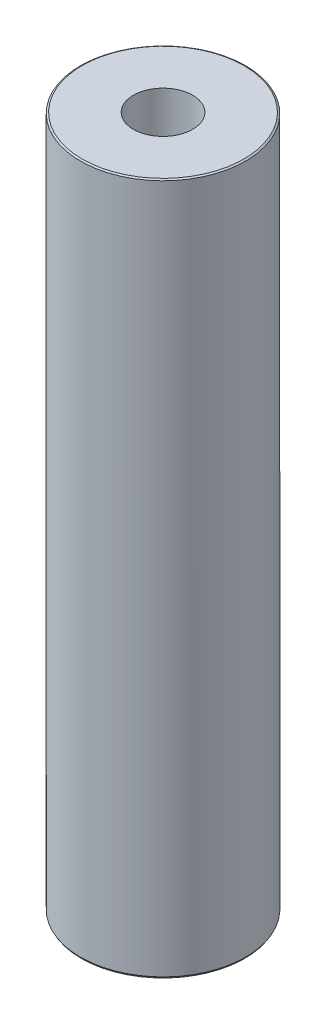
ISO-10303-21;
HEADER;
FILE_DESCRIPTION(('STEP AP214'),'2;1');
FILE_NAME('part.step','',(''),(''),'','','');
FILE_SCHEMA(('AUTOMOTIVE_DESIGN { 1 0 10303 214 1 1 1 1 }'));
ENDSEC;
DATA;
#1=APPLICATION_CONTEXT('core data for automotive mechanical design processes');
#2=APPLICATION_PROTOCOL_DEFINITION('international standard','automotive_design',2000,#1);
#3=PRODUCT_CONTEXT('',#1,'mechanical');
#4=PRODUCT('Part','Part','',(#3));
#5=PRODUCT_RELATED_PRODUCT_CATEGORY('part','',(#4));
#6=PRODUCT_DEFINITION_FORMATION('','',#4);
#7=PRODUCT_DEFINITION_CONTEXT('part definition',#1,'design');
#8=PRODUCT_DEFINITION('design','',#6,#7);
#9=PRODUCT_DEFINITION_SHAPE('','',#8);
#10=(LENGTH_UNIT() NAMED_UNIT(*) SI_UNIT(.MILLI.,.METRE.));
#11=(NAMED_UNIT(*) PLANE_ANGLE_UNIT() SI_UNIT($,.RADIAN.));
#12=(NAMED_UNIT(*) SI_UNIT($,.STERADIAN.) SOLID_ANGLE_UNIT());
#13=UNCERTAINTY_MEASURE_WITH_UNIT(LENGTH_MEASURE(1.E-05),#10,'distance_accuracy_value','');
#14=(GEOMETRIC_REPRESENTATION_CONTEXT(3) GLOBAL_UNCERTAINTY_ASSIGNED_CONTEXT((#13)) GLOBAL_UNIT_ASSIGNED_CONTEXT((#10,
#11,#12)) REPRESENTATION_CONTEXT('',''));
#15=CARTESIAN_POINT('',(0.,0.,0.));
#16=DIRECTION('',(0.,0.,1.));
#17=DIRECTION('',(1.,0.,0.));
#18=AXIS2_PLACEMENT_3D('',#15,#16,#17);
#19=CARTESIAN_POINT('',(0.,209.45475433606,0.));
#20=DIRECTION('',(0.,-1.,0.));
#21=DIRECTION('',(0.,0.,-1.));
#22=AXIS2_PLACEMENT_3D('',#19,#20,#21);
#23=CYLINDRICAL_SURFACE('',#22,25.);
#24=CARTESIAN_POINT('',(0.,209.166265374616,0.));
#25=DIRECTION('',(0.,1.,0.));
#26=DIRECTION('',(0.,0.,1.));
#27=AXIS2_PLACEMENT_3D('',#24,#25,#26);
#28=CIRCLE('',#27,25.);
#29=CARTESIAN_POINT('',(0.,209.166265374616,-25.));
#30=VERTEX_POINT('',#29);
#31=EDGE_CURVE('E50',#30,#30,#28,.F.);
#32=CARTESIAN_POINT('',(0.,0.499677538644716,0.));
#33=DIRECTION('',(0.,1.,0.));
#34=DIRECTION('',(0.,0.,1.));
#35=AXIS2_PLACEMENT_3D('',#32,#33,#34);
#36=CIRCLE('',#35,25.);
#37=CARTESIAN_POINT('',(0.,0.499677538644688,-25.));
#38=VERTEX_POINT('',#37);
#39=EDGE_CURVE('E51',#38,#38,#36,.T.);
#40=CARTESIAN_POINT('',(0.,209.166265374616,-25.));
#41=CARTESIAN_POINT('',(0.,206.992655084658,-25.));
#42=CARTESIAN_POINT('',(0.,204.8190447947,-25.));
#43=CARTESIAN_POINT('',(0.,200.471824214784,-25.));
#44=CARTESIAN_POINT('',(0.,198.298213924826,-25.));
#45=CARTESIAN_POINT('',(0.,193.95099334491,-25.));
#46=CARTESIAN_POINT('',(0.,191.777383054952,-25.));
#47=CARTESIAN_POINT('',(0.,187.430162475036,-25.));
#48=CARTESIAN_POINT('',(0.,185.256552185078,-25.));
#49=CARTESIAN_POINT('',(0.,180.909331605162,-25.));
#50=CARTESIAN_POINT('',(0.,178.735721315204,-25.));
#51=CARTESIAN_POINT('',(0.,174.388500735287,-25.));
#52=CARTESIAN_POINT('',(0.,172.214890445329,-25.));
#53=CARTESIAN_POINT('',(0.,167.867669865413,-25.));
#54=CARTESIAN_POINT('',(0.,165.694059575455,-25.));
#55=CARTESIAN_POINT('',(0.,161.346838995539,-25.));
#56=CARTESIAN_POINT('',(0.,159.173228705581,-25.));
#57=CARTESIAN_POINT('',(0.,154.826008125665,-25.));
#58=CARTESIAN_POINT('',(0.,152.652397835707,-25.));
#59=CARTESIAN_POINT('',(0.,148.305177255791,-25.));
#60=CARTESIAN_POINT('',(0.,146.131566965833,-25.));
#61=CARTESIAN_POINT('',(0.,141.784346385917,-25.));
#62=CARTESIAN_POINT('',(0.,139.610736095959,-25.));
#63=CARTESIAN_POINT('',(0.,135.263515516043,-25.));
#64=CARTESIAN_POINT('',(0.,133.089905226085,-25.));
#65=CARTESIAN_POINT('',(0.,128.742684646169,-25.));
#66=CARTESIAN_POINT('',(0.,126.569074356211,-25.));
#67=CARTESIAN_POINT('',(0.,122.221853776295,-25.));
#68=CARTESIAN_POINT('',(0.,120.048243486337,-25.));
#69=CARTESIAN_POINT('',(0.,115.701022906421,-25.));
#70=CARTESIAN_POINT('',(0.,113.527412616463,-25.));
#71=CARTESIAN_POINT('',(0.,109.180192036546,-25.));
#72=CARTESIAN_POINT('',(0.,107.006581746588,-25.));
#73=CARTESIAN_POINT('',(0.,102.659361166672,-25.));
#74=CARTESIAN_POINT('',(0.,100.485750876714,-25.));
#75=CARTESIAN_POINT('',(0.,96.1385302967982,-25.));
#76=CARTESIAN_POINT('',(0.,93.9649200068402,-25.));
#77=CARTESIAN_POINT('',(0.,89.6176994269241,-25.));
#78=CARTESIAN_POINT('',(0.,87.4440891369661,-25.));
#79=CARTESIAN_POINT('',(0.,83.09686855705,-25.));
#80=CARTESIAN_POINT('',(0.,80.923258267092,-25.));
#81=CARTESIAN_POINT('',(0.,76.5760376871759,-25.));
#82=CARTESIAN_POINT('',(0.,74.4024273972179,-25.));
#83=CARTESIAN_POINT('',(0.,70.0552068173018,-25.));
#84=CARTESIAN_POINT('',(0.,67.8815965273438,-25.));
#85=CARTESIAN_POINT('',(0.,63.5343759474277,-25.));
#86=CARTESIAN_POINT('',(0.,61.3607656574697,-25.));
#87=CARTESIAN_POINT('',(0.,57.0135450775536,-25.));
#88=CARTESIAN_POINT('',(0.,54.8399347875956,-25.));
#89=CARTESIAN_POINT('',(0.,50.4927142076795,-25.));
#90=CARTESIAN_POINT('',(0.,48.3191039177215,-25.));
#91=CARTESIAN_POINT('',(0.,43.9718833378054,-25.));
#92=CARTESIAN_POINT('',(0.,41.7982730478474,-25.));
#93=CARTESIAN_POINT('',(0.,37.4510524679313,-25.));
#94=CARTESIAN_POINT('',(0.,35.2774421779732,-25.));
#95=CARTESIAN_POINT('',(0.,30.9302215980572,-25.));
#96=CARTESIAN_POINT('',(0.,28.7566113080992,-25.));
#97=CARTESIAN_POINT('',(0.,24.4093907281831,-25.));
#98=CARTESIAN_POINT('',(0.,22.2357804382251,-25.));
#99=CARTESIAN_POINT('',(0.,17.888559858309,-25.));
#100=CARTESIAN_POINT('',(0.,15.714949568351,-25.));
#101=CARTESIAN_POINT('',(0.,11.3677289884349,-25.));
#102=CARTESIAN_POINT('',(0.,9.19411869847683,-25.));
#103=CARTESIAN_POINT('',(0.,4.84689811856075,-25.));
#104=CARTESIAN_POINT('',(0.,2.67328782860272,-25.));
#105=CARTESIAN_POINT('',(0.,0.499677538644688,-25.));
#106=B_SPLINE_CURVE_WITH_KNOTS('',3,(#40,#41,#42,#43,#44,#45,#46,#47,#48,#49,#50,#51,#52,#53,
#54,#55,#56,#57,#58,#59,#60,#61,#62,#63,#64,#65,#66,#67,#68,#69,#70,#71,#72,#73,#74,#75,#76,#77,
#78,#79,#80,#81,#82,#83,#84,#85,#86,#87,#88,#89,#90,#91,#92,#93,#94,#95,#96,#97,#98,#99,#100,
#101,#102,#103,#104,#105),.UNSPECIFIED.,.F.,.F.,(4,2,2,2,2,2,2,2,2,2,2,2,2,2,2,2,2,2,2,2,2,2,2,
2,2,2,2,2,2,2,2,2,4),(0.,6.52083086987412,13.0416617397482,19.5624926096223,26.0833234794964,
32.6041543493705,39.1249852192446,45.6458160891187,52.1666469589928,58.687477828867,
65.2083086987411,71.7291395686152,78.2499704384893,84.7708013083634,91.2916321782375,
97.8124630481116,104.333293917986,110.85412478786,117.374955657734,123.895786527608,
130.416617397482,136.937448267356,143.45827913723,149.979110007104,156.499940876978,
163.020771746853,169.541602616727,176.062433486601,182.583264356475,189.104095226349,
195.624926096223,202.145756966097,208.666587835971),.UNSPECIFIED.);
#107=EDGE_CURVE('BSEAM39',#30,#38,#106,.T.);
#108=ORIENTED_EDGE('',*,*,#31,.T.);
#109=ORIENTED_EDGE('',*,*,#39,.T.);
#110=ORIENTED_EDGE('',*,*,#107,.T.);
#111=ORIENTED_EDGE('',*,*,#107,.F.);
#112=EDGE_LOOP('',(#108,#110,#109,#111));
#113=FACE_BOUND('',#112,.T.);
#114=ADVANCED_FACE('F39',(#113),#23,.T.);
#115=CARTESIAN_POINT('',(0.,209.45475433606,0.));
#116=DIRECTION('',(0.,1.,0.));
#117=DIRECTION('',(0.,0.,1.));
#118=AXIS2_PLACEMENT_3D('',#115,#116,#117);
#119=PLANE('',#118);
#120=CARTESIAN_POINT('',(0.,209.45475433606,0.));
#121=DIRECTION('',(0.,1.,0.));
#122=DIRECTION('',(0.,0.,1.));
#123=AXIS2_PLACEMENT_3D('',#120,#121,#122);
#124=CIRCLE('',#123,24.5003224613559);
#125=CARTESIAN_POINT('',(0.,209.45475433606,24.5003224613559));
#126=VERTEX_POINT('',#125);
#127=EDGE_CURVE('E54',#126,#126,#124,.T.);
#128=ORIENTED_EDGE('',*,*,#127,.T.);
#129=EDGE_LOOP('',(#128));
#130=FACE_BOUND('',#129,.T.);
#131=CARTESIAN_POINT('',(0.,209.45475433606,0.));
#132=DIRECTION('',(0.,1.,0.));
#133=DIRECTION('',(0.,0.,1.));
#134=AXIS2_PLACEMENT_3D('',#131,#132,#133);
#135=CIRCLE('',#134,8.96062597463611);
#136=CARTESIAN_POINT('',(0.,209.45475433606,-8.96062597463611));
#137=VERTEX_POINT('',#136);
#138=EDGE_CURVE('E58',#137,#137,#135,.T.);
#139=ORIENTED_EDGE('',*,*,#138,.F.);
#140=EDGE_LOOP('',(#139));
#141=FACE_BOUND('',#140,.T.);
#142=ADVANCED_FACE('F69',(#130,#141),#119,.T.);
#143=CARTESIAN_POINT('',(0.,0.,0.));
#144=DIRECTION('',(0.,1.,0.));
#145=DIRECTION('',(0.,0.,1.));
#146=AXIS2_PLACEMENT_3D('',#143,#144,#145);
#147=PLANE('',#146);
#148=CARTESIAN_POINT('',(0.,0.,0.));
#149=DIRECTION('',(0.,1.,0.));
#150=DIRECTION('',(0.,0.,1.));
#151=AXIS2_PLACEMENT_3D('',#148,#149,#150);
#152=CIRCLE('',#151,24.7115110385555);
#153=CARTESIAN_POINT('',(0.,0.,24.7115110385555));
#154=VERTEX_POINT('',#153);
#155=EDGE_CURVE('E10',#154,#154,#152,.F.);
#156=ORIENTED_EDGE('',*,*,#155,.T.);
#157=EDGE_LOOP('',(#156));
#158=FACE_BOUND('',#157,.T.);
#159=CARTESIAN_POINT('',(0.,0.,0.));
#160=DIRECTION('',(0.,1.,0.));
#161=DIRECTION('',(0.,0.,1.));
#162=AXIS2_PLACEMENT_3D('',#159,#160,#161);
#163=CIRCLE('',#162,8.96062597463611);
#164=CARTESIAN_POINT('',(0.,0.,-8.96062597463611));
#165=VERTEX_POINT('',#164);
#166=EDGE_CURVE('E63',#165,#165,#163,.T.);
#167=ORIENTED_EDGE('',*,*,#166,.T.);
#168=EDGE_LOOP('',(#167));
#169=FACE_BOUND('',#168,.T.);
#170=ADVANCED_FACE('F75',(#158,#169),#147,.F.);
#171=CARTESIAN_POINT('',(0.,209.45475433606,0.));
#172=DIRECTION('',(0.,-1.,0.));
#173=DIRECTION('',(0.,0.,-1.));
#174=AXIS2_PLACEMENT_3D('',#171,#172,#173);
#175=CYLINDRICAL_SURFACE('',#174,8.96062597463611);
#176=CARTESIAN_POINT('',(0.,209.45475433606,-8.96062597463611));
#177=CARTESIAN_POINT('',(0.,207.272933978393,-8.96062597463611));
#178=CARTESIAN_POINT('',(0.,205.091113620726,-8.96062597463611));
#179=CARTESIAN_POINT('',(0.,200.727472905391,-8.96062597463611));
#180=CARTESIAN_POINT('',(0.,198.545652547724,-8.96062597463611));
#181=CARTESIAN_POINT('',(0.,194.182011832389,-8.96062597463611));
#182=CARTESIAN_POINT('',(0.,192.000191474722,-8.96062597463611));
#183=CARTESIAN_POINT('',(0.,187.636550759387,-8.96062597463611));
#184=CARTESIAN_POINT('',(0.,185.45473040172,-8.96062597463611));
#185=CARTESIAN_POINT('',(0.,181.091089686385,-8.96062597463611));
#186=CARTESIAN_POINT('',(0.,178.909269328718,-8.96062597463611));
#187=CARTESIAN_POINT('',(0.,174.545628613384,-8.96062597463611));
#188=CARTESIAN_POINT('',(0.,172.363808255716,-8.96062597463611));
#189=CARTESIAN_POINT('',(0.,168.000167540382,-8.96062597463611));
#190=CARTESIAN_POINT('',(0.,165.818347182714,-8.96062597463611));
#191=CARTESIAN_POINT('',(0.,161.45470646738,-8.96062597463611));
#192=CARTESIAN_POINT('',(0.,159.272886109712,-8.96062597463611));
#193=CARTESIAN_POINT('',(0.,154.909245394378,-8.96062597463611));
#194=CARTESIAN_POINT('',(0.,152.727425036711,-8.96062597463611));
#195=CARTESIAN_POINT('',(0.,148.363784321376,-8.96062597463611));
#196=CARTESIAN_POINT('',(0.,146.181963963709,-8.96062597463611));
#197=CARTESIAN_POINT('',(0.,141.818323248374,-8.96062597463611));
#198=CARTESIAN_POINT('',(0.,139.636502890707,-8.96062597463611));
#199=CARTESIAN_POINT('',(0.,135.272862175372,-8.96062597463611));
#200=CARTESIAN_POINT('',(0.,133.091041817705,-8.96062597463611));
#201=CARTESIAN_POINT('',(0.,128.72740110237,-8.96062597463611));
#202=CARTESIAN_POINT('',(0.,126.545580744703,-8.96062597463611));
#203=CARTESIAN_POINT('',(0.,122.181940029368,-8.96062597463611));
#204=CARTESIAN_POINT('',(0.,120.000119671701,-8.96062597463611));
#205=CARTESIAN_POINT('',(0.,115.636478956367,-8.96062597463611));
#206=CARTESIAN_POINT('',(0.,113.454658598699,-8.96062597463611));
#207=CARTESIAN_POINT('',(0.,109.091017883365,-8.96062597463611));
#208=CARTESIAN_POINT('',(0.,106.909197525697,-8.96062597463611));
#209=CARTESIAN_POINT('',(0.,102.545556810363,-8.96062597463611));
#210=CARTESIAN_POINT('',(0.,100.363736452696,-8.96062597463611));
#211=CARTESIAN_POINT('',(0.,96.0000957373609,-8.96062597463611));
#212=CARTESIAN_POINT('',(0.,93.8182753796936,-8.96062597463611));
#213=CARTESIAN_POINT('',(0.,89.454634664359,-8.96062597463611));
#214=CARTESIAN_POINT('',(0.,87.2728143066918,-8.96062597463611));
#215=CARTESIAN_POINT('',(0.,82.9091735913572,-8.96062597463611));
#216=CARTESIAN_POINT('',(0.,80.7273532336899,-8.96062597463611));
#217=CARTESIAN_POINT('',(0.,76.3637125183553,-8.96062597463611));
#218=CARTESIAN_POINT('',(0.,74.181892160688,-8.96062597463611));
#219=CARTESIAN_POINT('',(0.,69.8182514453534,-8.96062597463611));
#220=CARTESIAN_POINT('',(0.,67.6364310876861,-8.96062597463611));
#221=CARTESIAN_POINT('',(0.,63.2727903723515,-8.96062597463611));
#222=CARTESIAN_POINT('',(0.,61.0909700146842,-8.96062597463611));
#223=CARTESIAN_POINT('',(0.,56.7273292993496,-8.96062597463611));
#224=CARTESIAN_POINT('',(0.,54.5455089416823,-8.96062597463611));
#225=CARTESIAN_POINT('',(0.,50.1818682263478,-8.96062597463611));
#226=CARTESIAN_POINT('',(0.,48.0000478686805,-8.96062597463611));
#227=CARTESIAN_POINT('',(0.,43.6364071533459,-8.96062597463611));
#228=CARTESIAN_POINT('',(0.,41.4545867956786,-8.96062597463611));
#229=CARTESIAN_POINT('',(0.,37.090946080344,-8.96062597463611));
#230=CARTESIAN_POINT('',(0.,34.9091257226767,-8.96062597463611));
#231=CARTESIAN_POINT('',(0.,30.5454850073421,-8.96062597463611));
#232=CARTESIAN_POINT('',(0.,28.3636646496748,-8.96062597463611));
#233=CARTESIAN_POINT('',(0.,24.0000239343402,-8.96062597463611));
#234=CARTESIAN_POINT('',(0.,21.8182035766729,-8.96062597463611));
#235=CARTESIAN_POINT('',(0.,17.4545628613383,-8.96062597463611));
#236=CARTESIAN_POINT('',(0.,15.272742503671,-8.96062597463611));
#237=CARTESIAN_POINT('',(0.,10.9091017883364,-8.96062597463611));
#238=CARTESIAN_POINT('',(0.,8.72728143066915,-8.96062597463611));
#239=CARTESIAN_POINT('',(0.,4.36364071533456,-8.96062597463611));
#240=CARTESIAN_POINT('',(0.,2.18182035766727,-8.96062597463611));
#241=CARTESIAN_POINT('',(0.,0.,-8.96062597463611));
#242=B_SPLINE_CURVE_WITH_KNOTS('',3,(#176,#177,#178,#179,#180,#181,#182,#183,#184,#185,#186,
#187,#188,#189,#190,#191,#192,#193,#194,#195,#196,#197,#198,#199,#200,#201,#202,#203,#204,#205,
#206,#207,#208,#209,#210,#211,#212,#213,#214,#215,#216,#217,#218,#219,#220,#221,#222,#223,#224,
#225,#226,#227,#228,#229,#230,#231,#232,#233,#234,#235,#236,#237,#238,#239,#240,#241),
.UNSPECIFIED.,.F.,.F.,(4,2,2,2,2,2,2,2,2,2,2,2,2,2,2,2,2,2,2,2,2,2,2,2,2,2,2,2,2,2,2,2,4),(0.,
6.54546107300186,13.0909221460037,19.6363832190056,26.1818442920075,32.7273053650094,
39.2727664380113,45.8182275110132,52.3636885840151,58.9091496570169,65.4546107300188,
72.0000718030207,78.5455328760226,85.0909939490245,91.6364550220263,98.1819160950282,
104.72737716803,111.272838241032,117.818299314034,124.363760387036,130.909221460038,
137.45468253304,144.000143606041,150.545604679043,157.091065752045,163.636526825047,
170.181987898049,176.727448971051,183.272910044053,189.818371117055,196.363832190056,
202.909293263058,209.45475433606),.UNSPECIFIED.);
#243=EDGE_CURVE('BSEAM70',#137,#165,#242,.T.);
#244=ORIENTED_EDGE('',*,*,#138,.T.);
#245=ORIENTED_EDGE('',*,*,#166,.F.);
#246=ORIENTED_EDGE('',*,*,#243,.T.);
#247=ORIENTED_EDGE('',*,*,#243,.F.);
#248=EDGE_LOOP('',(#244,#246,#245,#247));
#249=FACE_BOUND('',#248,.T.);
#250=ADVANCED_FACE('F70',(#249),#175,.F.);
#251=CARTESIAN_POINT('',(0.,209.45475433606,0.));
#252=DIRECTION('',(0.,-1.,0.));
#253=DIRECTION('',(0.,0.,-1.));
#254=AXIS2_PLACEMENT_3D('',#251,#252,#253);
#255=CONICAL_SURFACE('',#254,24.5003224613559,1.0471975511966);
#256=ORIENTED_EDGE('',*,*,#31,.F.);
#257=EDGE_LOOP('',(#256));
#258=FACE_BOUND('',#257,.T.);
#259=ORIENTED_EDGE('',*,*,#127,.F.);
#260=EDGE_LOOP('',(#259));
#261=FACE_BOUND('',#260,.T.);
#262=ADVANCED_FACE('F81',(#258,#261),#255,.T.);
#263=CARTESIAN_POINT('',(0.,0.499677538644716,0.));
#264=DIRECTION('',(0.,1.,0.));
#265=DIRECTION('',(0.,0.,1.));
#266=AXIS2_PLACEMENT_3D('',#263,#264,#265);
#267=CONICAL_SURFACE('',#266,25.,0.523598775598281);
#268=ORIENTED_EDGE('',*,*,#155,.F.);
#269=EDGE_LOOP('',(#268));
#270=FACE_BOUND('',#269,.T.);
#271=ORIENTED_EDGE('',*,*,#39,.F.);
#272=EDGE_LOOP('',(#271));
#273=FACE_BOUND('',#272,.T.);
#274=ADVANCED_FACE('F45',(#270,#273),#267,.T.);
#275=CLOSED_SHELL('',(#114,#142,#170,#250,#262,#274));
#276=MANIFOLD_SOLID_BREP('B2',#275);
#277=ADVANCED_BREP_SHAPE_REPRESENTATION('',(#18,#276),#14);
#278=SHAPE_DEFINITION_REPRESENTATION(#9,#277);
ENDSEC;
END-ISO-10303-21;
